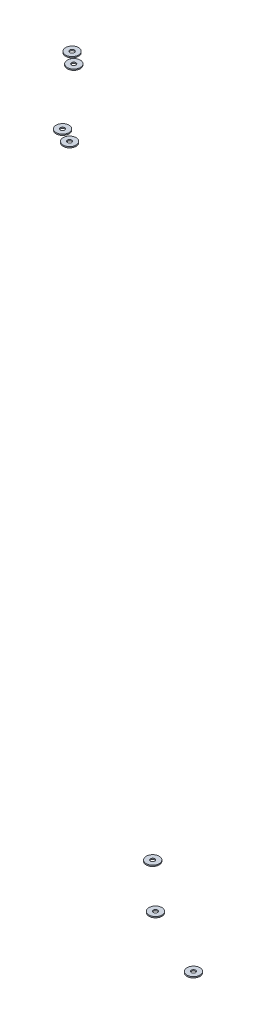
ISO-10303-21;
HEADER;
FILE_DESCRIPTION(('STEP AP214'),'2;1');
FILE_NAME('part.step','',(''),(''),'','','');
FILE_SCHEMA(('AUTOMOTIVE_DESIGN { 1 0 10303 214 1 1 1 1 }'));
ENDSEC;
DATA;
#1=APPLICATION_CONTEXT('core data for automotive mechanical design processes');
#2=APPLICATION_PROTOCOL_DEFINITION('international standard','automotive_design',2000,#1);
#3=PRODUCT_CONTEXT('',#1,'mechanical');
#4=PRODUCT('Part','Part','',(#3));
#5=PRODUCT_RELATED_PRODUCT_CATEGORY('part','',(#4));
#6=PRODUCT_DEFINITION_FORMATION('','',#4);
#7=PRODUCT_DEFINITION_CONTEXT('part definition',#1,'design');
#8=PRODUCT_DEFINITION('design','',#6,#7);
#9=PRODUCT_DEFINITION_SHAPE('','',#8);
#10=(LENGTH_UNIT() NAMED_UNIT(*) SI_UNIT(.MILLI.,.METRE.));
#11=(NAMED_UNIT(*) PLANE_ANGLE_UNIT() SI_UNIT($,.RADIAN.));
#12=(NAMED_UNIT(*) SI_UNIT($,.STERADIAN.) SOLID_ANGLE_UNIT());
#13=UNCERTAINTY_MEASURE_WITH_UNIT(LENGTH_MEASURE(1.E-05),#10,'distance_accuracy_value','');
#14=(GEOMETRIC_REPRESENTATION_CONTEXT(3) GLOBAL_UNCERTAINTY_ASSIGNED_CONTEXT((#13)) GLOBAL_UNIT_ASSIGNED_CONTEXT((#10,
#11,#12)) REPRESENTATION_CONTEXT('',''));
#15=CARTESIAN_POINT('',(0.,0.,0.));
#16=DIRECTION('',(0.,0.,1.));
#17=DIRECTION('',(1.,0.,0.));
#18=AXIS2_PLACEMENT_3D('',#15,#16,#17);
#19=CARTESIAN_POINT('',(-289.687055909534,293.9,-282.424125212571));
#20=DIRECTION('',(0.,-1.,0.));
#21=DIRECTION('',(0.,0.,1.));
#22=AXIS2_PLACEMENT_3D('',#19,#20,#21);
#23=PLANE('',#22);
#24=CARTESIAN_POINT('',(-289.687055909534,293.9,-282.424125212571));
#25=DIRECTION('',(0.,1.,0.));
#26=DIRECTION('',(0.,0.,1.));
#27=AXIS2_PLACEMENT_3D('',#24,#25,#26);
#28=CIRCLE('',#27,4.50000000000002);
#29=CARTESIAN_POINT('',(-289.687055909534,293.9,-277.924125212571));
#30=VERTEX_POINT('',#29);
#31=EDGE_CURVE('E11',#30,#30,#28,.T.);
#32=ORIENTED_EDGE('',*,*,#31,.F.);
#33=EDGE_LOOP('',(#32));
#34=FACE_BOUND('',#33,.T.);
#35=CARTESIAN_POINT('',(-289.687055909534,293.9,-282.424125212571));
#36=DIRECTION('',(0.,1.,0.));
#37=DIRECTION('',(0.,0.,1.));
#38=AXIS2_PLACEMENT_3D('',#35,#36,#37);
#39=CIRCLE('',#38,1.50000000000002);
#40=CARTESIAN_POINT('',(-289.687055909534,293.9,-280.924125212571));
#41=VERTEX_POINT('',#40);
#42=EDGE_CURVE('E55',#41,#41,#39,.T.);
#43=ORIENTED_EDGE('',*,*,#42,.T.);
#44=EDGE_LOOP('',(#43));
#45=FACE_BOUND('',#44,.T.);
#46=ADVANCED_FACE('F44',(#34,#45),#23,.T.);
#47=CARTESIAN_POINT('',(-289.687055909534,294.7,-282.424125212571));
#48=DIRECTION('',(0.,-1.,0.));
#49=DIRECTION('',(0.,0.,1.));
#50=AXIS2_PLACEMENT_3D('',#47,#48,#49);
#51=PLANE('',#50);
#52=CARTESIAN_POINT('',(-289.687055909534,294.7,-282.424125212571));
#53=DIRECTION('',(0.,1.,0.));
#54=DIRECTION('',(0.,0.,1.));
#55=AXIS2_PLACEMENT_3D('',#52,#53,#54);
#56=CIRCLE('',#55,4.50000000000002);
#57=CARTESIAN_POINT('',(-289.687055909534,294.7,-277.924125212571));
#58=VERTEX_POINT('',#57);
#59=EDGE_CURVE('E48',#58,#58,#56,.T.);
#60=ORIENTED_EDGE('',*,*,#59,.T.);
#61=EDGE_LOOP('',(#60));
#62=FACE_BOUND('',#61,.T.);
#63=CARTESIAN_POINT('',(-289.687055909534,294.7,-282.424125212571));
#64=DIRECTION('',(0.,1.,0.));
#65=DIRECTION('',(0.,0.,1.));
#66=AXIS2_PLACEMENT_3D('',#63,#64,#65);
#67=CIRCLE('',#66,1.50000000000002);
#68=CARTESIAN_POINT('',(-289.687055909534,294.7,-280.924125212571));
#69=VERTEX_POINT('',#68);
#70=EDGE_CURVE('E57',#69,#69,#67,.T.);
#71=ORIENTED_EDGE('',*,*,#70,.F.);
#72=EDGE_LOOP('',(#71));
#73=FACE_BOUND('',#72,.T.);
#74=ADVANCED_FACE('F70',(#62,#73),#51,.F.);
#75=CARTESIAN_POINT('',(-289.687055909534,293.9,-282.424125212571));
#76=DIRECTION('',(0.,1.,0.));
#77=DIRECTION('',(0.,0.,-1.));
#78=AXIS2_PLACEMENT_3D('',#75,#76,#77);
#79=CYLINDRICAL_SURFACE('',#78,4.50000000000002);
#80=ORIENTED_EDGE('',*,*,#31,.T.);
#81=EDGE_LOOP('',(#80));
#82=FACE_BOUND('',#81,.T.);
#83=ORIENTED_EDGE('',*,*,#59,.F.);
#84=EDGE_LOOP('',(#83));
#85=FACE_BOUND('',#84,.T.);
#86=ADVANCED_FACE('F46',(#82,#85),#79,.T.);
#87=CARTESIAN_POINT('',(-289.687055909534,293.9,-282.424125212571));
#88=DIRECTION('',(0.,1.,0.));
#89=DIRECTION('',(0.,0.,-1.));
#90=AXIS2_PLACEMENT_3D('',#87,#88,#89);
#91=CYLINDRICAL_SURFACE('',#90,1.50000000000002);
#92=ORIENTED_EDGE('',*,*,#42,.F.);
#93=EDGE_LOOP('',(#92));
#94=FACE_BOUND('',#93,.T.);
#95=ORIENTED_EDGE('',*,*,#70,.T.);
#96=EDGE_LOOP('',(#95));
#97=FACE_BOUND('',#96,.T.);
#98=ADVANCED_FACE('F64',(#94,#97),#91,.F.);
#99=CLOSED_SHELL('',(#46,#74,#86,#98));
#100=MANIFOLD_SOLID_BREP('B2',#99);
#101=CARTESIAN_POINT('',(-339.082998520851,293.9,-305.429754445409));
#102=DIRECTION('',(0.,-1.,0.));
#103=DIRECTION('',(0.,0.,1.));
#104=AXIS2_PLACEMENT_3D('',#101,#102,#103);
#105=PLANE('',#104);
#106=CARTESIAN_POINT('',(-339.082998520851,293.9,-305.429754445409));
#107=DIRECTION('',(0.,1.,0.));
#108=DIRECTION('',(0.,0.,1.));
#109=AXIS2_PLACEMENT_3D('',#106,#107,#108);
#110=CIRCLE('',#109,4.50000000000002);
#111=CARTESIAN_POINT('',(-339.082998520851,293.9,-300.929754445409));
#112=VERTEX_POINT('',#111);
#113=EDGE_CURVE('E43',#112,#112,#110,.T.);
#114=ORIENTED_EDGE('',*,*,#113,.F.);
#115=EDGE_LOOP('',(#114));
#116=FACE_BOUND('',#115,.T.);
#117=CARTESIAN_POINT('',(-339.082998520851,293.9,-305.429754445409));
#118=DIRECTION('',(0.,1.,0.));
#119=DIRECTION('',(0.,0.,1.));
#120=AXIS2_PLACEMENT_3D('',#117,#118,#119);
#121=CIRCLE('',#120,1.50000000000002);
#122=CARTESIAN_POINT('',(-339.082998520851,293.9,-303.929754445409));
#123=VERTEX_POINT('',#122);
#124=EDGE_CURVE('E125',#123,#123,#121,.T.);
#125=ORIENTED_EDGE('',*,*,#124,.T.);
#126=EDGE_LOOP('',(#125));
#127=FACE_BOUND('',#126,.T.);
#128=ADVANCED_FACE('F114',(#116,#127),#105,.T.);
#129=CARTESIAN_POINT('',(-339.082998520851,294.7,-305.429754445409));
#130=DIRECTION('',(0.,-1.,0.));
#131=DIRECTION('',(0.,0.,1.));
#132=AXIS2_PLACEMENT_3D('',#129,#130,#131);
#133=PLANE('',#132);
#134=CARTESIAN_POINT('',(-339.082998520851,294.7,-305.429754445409));
#135=DIRECTION('',(0.,1.,0.));
#136=DIRECTION('',(0.,0.,1.));
#137=AXIS2_PLACEMENT_3D('',#134,#135,#136);
#138=CIRCLE('',#137,4.50000000000002);
#139=CARTESIAN_POINT('',(-339.082998520851,294.7,-300.929754445409));
#140=VERTEX_POINT('',#139);
#141=EDGE_CURVE('E118',#140,#140,#138,.T.);
#142=ORIENTED_EDGE('',*,*,#141,.T.);
#143=EDGE_LOOP('',(#142));
#144=FACE_BOUND('',#143,.T.);
#145=CARTESIAN_POINT('',(-339.082998520851,294.7,-305.429754445409));
#146=DIRECTION('',(0.,1.,0.));
#147=DIRECTION('',(0.,0.,1.));
#148=AXIS2_PLACEMENT_3D('',#145,#146,#147);
#149=CIRCLE('',#148,1.50000000000002);
#150=CARTESIAN_POINT('',(-339.082998520851,294.7,-303.929754445409));
#151=VERTEX_POINT('',#150);
#152=EDGE_CURVE('E127',#151,#151,#149,.T.);
#153=ORIENTED_EDGE('',*,*,#152,.F.);
#154=EDGE_LOOP('',(#153));
#155=FACE_BOUND('',#154,.T.);
#156=ADVANCED_FACE('F140',(#144,#155),#133,.F.);
#157=CARTESIAN_POINT('',(-339.082998520851,293.9,-305.429754445409));
#158=DIRECTION('',(0.,1.,0.));
#159=DIRECTION('',(0.,0.,-1.));
#160=AXIS2_PLACEMENT_3D('',#157,#158,#159);
#161=CYLINDRICAL_SURFACE('',#160,4.50000000000002);
#162=ORIENTED_EDGE('',*,*,#113,.T.);
#163=EDGE_LOOP('',(#162));
#164=FACE_BOUND('',#163,.T.);
#165=ORIENTED_EDGE('',*,*,#141,.F.);
#166=EDGE_LOOP('',(#165));
#167=FACE_BOUND('',#166,.T.);
#168=ADVANCED_FACE('F116',(#164,#167),#161,.T.);
#169=CARTESIAN_POINT('',(-339.082998520851,293.9,-305.429754445409));
#170=DIRECTION('',(0.,1.,0.));
#171=DIRECTION('',(0.,0.,-1.));
#172=AXIS2_PLACEMENT_3D('',#169,#170,#171);
#173=CYLINDRICAL_SURFACE('',#172,1.50000000000002);
#174=ORIENTED_EDGE('',*,*,#124,.F.);
#175=EDGE_LOOP('',(#174));
#176=FACE_BOUND('',#175,.T.);
#177=ORIENTED_EDGE('',*,*,#152,.T.);
#178=EDGE_LOOP('',(#177));
#179=FACE_BOUND('',#178,.T.);
#180=ADVANCED_FACE('F134',(#176,#179),#173,.F.);
#181=CLOSED_SHELL('',(#128,#156,#168,#180));
#182=MANIFOLD_SOLID_BREP('B6',#181);
#183=CARTESIAN_POINT('',(-370.956911026411,293.9,-335.367132453118));
#184=DIRECTION('',(0.,-1.,0.));
#185=DIRECTION('',(0.,0.,1.));
#186=AXIS2_PLACEMENT_3D('',#183,#184,#185);
#187=PLANE('',#186);
#188=CARTESIAN_POINT('',(-370.956911026411,293.9,-335.367132453118));
#189=DIRECTION('',(0.,1.,0.));
#190=DIRECTION('',(0.,0.,1.));
#191=AXIS2_PLACEMENT_3D('',#188,#189,#190);
#192=CIRCLE('',#191,4.50000000000002);
#193=CARTESIAN_POINT('',(-370.956911026411,293.9,-330.867132453118));
#194=VERTEX_POINT('',#193);
#195=EDGE_CURVE('E113',#194,#194,#192,.T.);
#196=ORIENTED_EDGE('',*,*,#195,.F.);
#197=EDGE_LOOP('',(#196));
#198=FACE_BOUND('',#197,.T.);
#199=CARTESIAN_POINT('',(-370.956911026411,293.9,-335.367132453118));
#200=DIRECTION('',(0.,1.,0.));
#201=DIRECTION('',(0.,0.,1.));
#202=AXIS2_PLACEMENT_3D('',#199,#200,#201);
#203=CIRCLE('',#202,1.50000000000002);
#204=CARTESIAN_POINT('',(-370.956911026411,293.9,-333.867132453118));
#205=VERTEX_POINT('',#204);
#206=EDGE_CURVE('E195',#205,#205,#203,.T.);
#207=ORIENTED_EDGE('',*,*,#206,.T.);
#208=EDGE_LOOP('',(#207));
#209=FACE_BOUND('',#208,.T.);
#210=ADVANCED_FACE('F184',(#198,#209),#187,.T.);
#211=CARTESIAN_POINT('',(-370.956911026411,294.7,-335.367132453118));
#212=DIRECTION('',(0.,-1.,0.));
#213=DIRECTION('',(0.,0.,1.));
#214=AXIS2_PLACEMENT_3D('',#211,#212,#213);
#215=PLANE('',#214);
#216=CARTESIAN_POINT('',(-370.956911026411,294.7,-335.367132453118));
#217=DIRECTION('',(0.,1.,0.));
#218=DIRECTION('',(0.,0.,1.));
#219=AXIS2_PLACEMENT_3D('',#216,#217,#218);
#220=CIRCLE('',#219,4.50000000000002);
#221=CARTESIAN_POINT('',(-370.956911026411,294.7,-330.867132453118));
#222=VERTEX_POINT('',#221);
#223=EDGE_CURVE('E188',#222,#222,#220,.T.);
#224=ORIENTED_EDGE('',*,*,#223,.T.);
#225=EDGE_LOOP('',(#224));
#226=FACE_BOUND('',#225,.T.);
#227=CARTESIAN_POINT('',(-370.956911026411,294.7,-335.367132453118));
#228=DIRECTION('',(0.,1.,0.));
#229=DIRECTION('',(0.,0.,1.));
#230=AXIS2_PLACEMENT_3D('',#227,#228,#229);
#231=CIRCLE('',#230,1.50000000000002);
#232=CARTESIAN_POINT('',(-370.956911026411,294.7,-333.867132453118));
#233=VERTEX_POINT('',#232);
#234=EDGE_CURVE('E197',#233,#233,#231,.T.);
#235=ORIENTED_EDGE('',*,*,#234,.F.);
#236=EDGE_LOOP('',(#235));
#237=FACE_BOUND('',#236,.T.);
#238=ADVANCED_FACE('F210',(#226,#237),#215,.F.);
#239=CARTESIAN_POINT('',(-370.956911026411,293.9,-335.367132453118));
#240=DIRECTION('',(0.,1.,0.));
#241=DIRECTION('',(0.,0.,-1.));
#242=AXIS2_PLACEMENT_3D('',#239,#240,#241);
#243=CYLINDRICAL_SURFACE('',#242,4.50000000000002);
#244=ORIENTED_EDGE('',*,*,#195,.T.);
#245=EDGE_LOOP('',(#244));
#246=FACE_BOUND('',#245,.T.);
#247=ORIENTED_EDGE('',*,*,#223,.F.);
#248=EDGE_LOOP('',(#247));
#249=FACE_BOUND('',#248,.T.);
#250=ADVANCED_FACE('F186',(#246,#249),#243,.T.);
#251=CARTESIAN_POINT('',(-370.956911026411,293.9,-335.367132453118));
#252=DIRECTION('',(0.,1.,0.));
#253=DIRECTION('',(0.,0.,-1.));
#254=AXIS2_PLACEMENT_3D('',#251,#252,#253);
#255=CYLINDRICAL_SURFACE('',#254,1.50000000000002);
#256=ORIENTED_EDGE('',*,*,#206,.F.);
#257=EDGE_LOOP('',(#256));
#258=FACE_BOUND('',#257,.T.);
#259=ORIENTED_EDGE('',*,*,#234,.T.);
#260=EDGE_LOOP('',(#259));
#261=FACE_BOUND('',#260,.T.);
#262=ADVANCED_FACE('F204',(#258,#261),#255,.F.);
#263=CLOSED_SHELL('',(#210,#238,#250,#262));
#264=MANIFOLD_SOLID_BREP('B38',#263);
#265=CARTESIAN_POINT('',(-474.449169572246,706.1,-382.793687092254));
#266=DIRECTION('',(0.,1.,0.));
#267=DIRECTION('',(0.,0.,-1.));
#268=AXIS2_PLACEMENT_3D('',#265,#266,#267);
#269=PLANE('',#268);
#270=CARTESIAN_POINT('',(-474.449169572246,706.1,-382.793687092254));
#271=DIRECTION('',(0.,-1.,0.));
#272=DIRECTION('',(0.,0.,-1.));
#273=AXIS2_PLACEMENT_3D('',#270,#271,#272);
#274=CIRCLE('',#273,4.50000000000002);
#275=CARTESIAN_POINT('',(-474.449169572246,706.1,-387.293687092254));
#276=VERTEX_POINT('',#275);
#277=EDGE_CURVE('E183',#276,#276,#274,.T.);
#278=ORIENTED_EDGE('',*,*,#277,.F.);
#279=EDGE_LOOP('',(#278));
#280=FACE_BOUND('',#279,.T.);
#281=CARTESIAN_POINT('',(-474.449169572246,706.1,-382.793687092254));
#282=DIRECTION('',(0.,-1.,0.));
#283=DIRECTION('',(0.,0.,-1.));
#284=AXIS2_PLACEMENT_3D('',#281,#282,#283);
#285=CIRCLE('',#284,1.6059145248098);
#286=CARTESIAN_POINT('',(-474.449169572246,706.1,-384.399601617063));
#287=VERTEX_POINT('',#286);
#288=EDGE_CURVE('E265',#287,#287,#285,.T.);
#289=ORIENTED_EDGE('',*,*,#288,.T.);
#290=EDGE_LOOP('',(#289));
#291=FACE_BOUND('',#290,.T.);
#292=ADVANCED_FACE('F254',(#280,#291),#269,.T.);
#293=CARTESIAN_POINT('',(-474.449169572246,705.3,-382.793687092254));
#294=DIRECTION('',(0.,1.,0.));
#295=DIRECTION('',(0.,0.,-1.));
#296=AXIS2_PLACEMENT_3D('',#293,#294,#295);
#297=PLANE('',#296);
#298=CARTESIAN_POINT('',(-474.449169572246,705.3,-382.793687092254));
#299=DIRECTION('',(0.,-1.,0.));
#300=DIRECTION('',(0.,0.,-1.));
#301=AXIS2_PLACEMENT_3D('',#298,#299,#300);
#302=CIRCLE('',#301,4.50000000000002);
#303=CARTESIAN_POINT('',(-474.449169572246,705.3,-387.293687092254));
#304=VERTEX_POINT('',#303);
#305=EDGE_CURVE('E258',#304,#304,#302,.T.);
#306=ORIENTED_EDGE('',*,*,#305,.T.);
#307=EDGE_LOOP('',(#306));
#308=FACE_BOUND('',#307,.T.);
#309=CARTESIAN_POINT('',(-474.449169572246,705.3,-382.793687092254));
#310=DIRECTION('',(0.,-1.,0.));
#311=DIRECTION('',(0.,0.,-1.));
#312=AXIS2_PLACEMENT_3D('',#309,#310,#311);
#313=CIRCLE('',#312,1.6059145248098);
#314=CARTESIAN_POINT('',(-474.449169572246,705.3,-384.399601617063));
#315=VERTEX_POINT('',#314);
#316=EDGE_CURVE('E267',#315,#315,#313,.T.);
#317=ORIENTED_EDGE('',*,*,#316,.F.);
#318=EDGE_LOOP('',(#317));
#319=FACE_BOUND('',#318,.T.);
#320=ADVANCED_FACE('F280',(#308,#319),#297,.F.);
#321=CARTESIAN_POINT('',(-474.449169572246,706.1,-382.793687092254));
#322=DIRECTION('',(0.,-1.,0.));
#323=DIRECTION('',(0.,0.,1.));
#324=AXIS2_PLACEMENT_3D('',#321,#322,#323);
#325=CYLINDRICAL_SURFACE('',#324,4.50000000000002);
#326=ORIENTED_EDGE('',*,*,#277,.T.);
#327=EDGE_LOOP('',(#326));
#328=FACE_BOUND('',#327,.T.);
#329=ORIENTED_EDGE('',*,*,#305,.F.);
#330=EDGE_LOOP('',(#329));
#331=FACE_BOUND('',#330,.T.);
#332=ADVANCED_FACE('F256',(#328,#331),#325,.T.);
#333=CARTESIAN_POINT('',(-474.449169572246,706.1,-382.793687092254));
#334=DIRECTION('',(0.,-1.,0.));
#335=DIRECTION('',(0.,0.,1.));
#336=AXIS2_PLACEMENT_3D('',#333,#334,#335);
#337=CYLINDRICAL_SURFACE('',#336,1.6059145248098);
#338=ORIENTED_EDGE('',*,*,#288,.F.);
#339=EDGE_LOOP('',(#338));
#340=FACE_BOUND('',#339,.T.);
#341=ORIENTED_EDGE('',*,*,#316,.T.);
#342=EDGE_LOOP('',(#341));
#343=FACE_BOUND('',#342,.T.);
#344=ADVANCED_FACE('F274',(#340,#343),#337,.F.);
#345=CLOSED_SHELL('',(#292,#320,#332,#344));
#346=MANIFOLD_SOLID_BREP('B108',#345);
#347=CARTESIAN_POINT('',(-466.308050673724,706.1,-375.859415010098));
#348=DIRECTION('',(0.,1.,0.));
#349=DIRECTION('',(0.,0.,-1.));
#350=AXIS2_PLACEMENT_3D('',#347,#348,#349);
#351=PLANE('',#350);
#352=CARTESIAN_POINT('',(-466.308050673724,706.1,-375.859415010098));
#353=DIRECTION('',(0.,-1.,0.));
#354=DIRECTION('',(0.,0.,-1.));
#355=AXIS2_PLACEMENT_3D('',#352,#353,#354);
#356=CIRCLE('',#355,4.50000000000002);
#357=CARTESIAN_POINT('',(-466.308050673724,706.1,-380.359415010098));
#358=VERTEX_POINT('',#357);
#359=EDGE_CURVE('E253',#358,#358,#356,.T.);
#360=ORIENTED_EDGE('',*,*,#359,.F.);
#361=EDGE_LOOP('',(#360));
#362=FACE_BOUND('',#361,.T.);
#363=CARTESIAN_POINT('',(-466.308050673724,706.1,-375.859415010098));
#364=DIRECTION('',(0.,-1.,0.));
#365=DIRECTION('',(0.,0.,-1.));
#366=AXIS2_PLACEMENT_3D('',#363,#364,#365);
#367=CIRCLE('',#366,1.50000000000002);
#368=CARTESIAN_POINT('',(-466.308050673724,706.1,-377.359415010098));
#369=VERTEX_POINT('',#368);
#370=EDGE_CURVE('E335',#369,#369,#367,.T.);
#371=ORIENTED_EDGE('',*,*,#370,.T.);
#372=EDGE_LOOP('',(#371));
#373=FACE_BOUND('',#372,.T.);
#374=ADVANCED_FACE('F324',(#362,#373),#351,.T.);
#375=CARTESIAN_POINT('',(-466.308050673724,705.3,-375.859415010098));
#376=DIRECTION('',(0.,1.,0.));
#377=DIRECTION('',(0.,0.,-1.));
#378=AXIS2_PLACEMENT_3D('',#375,#376,#377);
#379=PLANE('',#378);
#380=CARTESIAN_POINT('',(-466.308050673724,705.3,-375.859415010098));
#381=DIRECTION('',(0.,-1.,0.));
#382=DIRECTION('',(0.,0.,-1.));
#383=AXIS2_PLACEMENT_3D('',#380,#381,#382);
#384=CIRCLE('',#383,4.50000000000002);
#385=CARTESIAN_POINT('',(-466.308050673724,705.3,-380.359415010098));
#386=VERTEX_POINT('',#385);
#387=EDGE_CURVE('E328',#386,#386,#384,.T.);
#388=ORIENTED_EDGE('',*,*,#387,.T.);
#389=EDGE_LOOP('',(#388));
#390=FACE_BOUND('',#389,.T.);
#391=CARTESIAN_POINT('',(-466.308050673724,705.3,-375.859415010098));
#392=DIRECTION('',(0.,-1.,0.));
#393=DIRECTION('',(0.,0.,-1.));
#394=AXIS2_PLACEMENT_3D('',#391,#392,#393);
#395=CIRCLE('',#394,1.50000000000002);
#396=CARTESIAN_POINT('',(-466.308050673724,705.3,-377.359415010098));
#397=VERTEX_POINT('',#396);
#398=EDGE_CURVE('E337',#397,#397,#395,.T.);
#399=ORIENTED_EDGE('',*,*,#398,.F.);
#400=EDGE_LOOP('',(#399));
#401=FACE_BOUND('',#400,.T.);
#402=ADVANCED_FACE('F350',(#390,#401),#379,.F.);
#403=CARTESIAN_POINT('',(-466.308050673724,706.1,-375.859415010098));
#404=DIRECTION('',(0.,-1.,0.));
#405=DIRECTION('',(0.,0.,1.));
#406=AXIS2_PLACEMENT_3D('',#403,#404,#405);
#407=CYLINDRICAL_SURFACE('',#406,4.50000000000002);
#408=ORIENTED_EDGE('',*,*,#359,.T.);
#409=EDGE_LOOP('',(#408));
#410=FACE_BOUND('',#409,.T.);
#411=ORIENTED_EDGE('',*,*,#387,.F.);
#412=EDGE_LOOP('',(#411));
#413=FACE_BOUND('',#412,.T.);
#414=ADVANCED_FACE('F326',(#410,#413),#407,.T.);
#415=CARTESIAN_POINT('',(-466.308050673724,706.1,-375.859415010098));
#416=DIRECTION('',(0.,-1.,0.));
#417=DIRECTION('',(0.,0.,1.));
#418=AXIS2_PLACEMENT_3D('',#415,#416,#417);
#419=CYLINDRICAL_SURFACE('',#418,1.50000000000002);
#420=ORIENTED_EDGE('',*,*,#370,.F.);
#421=EDGE_LOOP('',(#420));
#422=FACE_BOUND('',#421,.T.);
#423=ORIENTED_EDGE('',*,*,#398,.T.);
#424=EDGE_LOOP('',(#423));
#425=FACE_BOUND('',#424,.T.);
#426=ADVANCED_FACE('F344',(#422,#425),#419,.F.);
#427=CLOSED_SHELL('',(#374,#402,#414,#426));
#428=MANIFOLD_SOLID_BREP('B178',#427);
#429=CARTESIAN_POINT('',(-431.039698401952,706.1,-332.774189517311));
#430=DIRECTION('',(0.,1.,0.));
#431=DIRECTION('',(0.,0.,-1.));
#432=AXIS2_PLACEMENT_3D('',#429,#430,#431);
#433=PLANE('',#432);
#434=CARTESIAN_POINT('',(-431.039698401952,706.1,-332.774189517311));
#435=DIRECTION('',(0.,-1.,0.));
#436=DIRECTION('',(0.,0.,-1.));
#437=AXIS2_PLACEMENT_3D('',#434,#435,#436);
#438=CIRCLE('',#437,4.50000000000002);
#439=CARTESIAN_POINT('',(-431.039698401952,706.1,-337.274189517311));
#440=VERTEX_POINT('',#439);
#441=EDGE_CURVE('E323',#440,#440,#438,.T.);
#442=ORIENTED_EDGE('',*,*,#441,.F.);
#443=EDGE_LOOP('',(#442));
#444=FACE_BOUND('',#443,.T.);
#445=CARTESIAN_POINT('',(-431.039698401952,706.1,-332.774189517311));
#446=DIRECTION('',(0.,-1.,0.));
#447=DIRECTION('',(0.,0.,-1.));
#448=AXIS2_PLACEMENT_3D('',#445,#446,#447);
#449=CIRCLE('',#448,1.49999999999997);
#450=CARTESIAN_POINT('',(-431.039698401952,706.1,-334.274189517311));
#451=VERTEX_POINT('',#450);
#452=EDGE_CURVE('E404',#451,#451,#449,.T.);
#453=ORIENTED_EDGE('',*,*,#452,.T.);
#454=EDGE_LOOP('',(#453));
#455=FACE_BOUND('',#454,.T.);
#456=ADVANCED_FACE('F393',(#444,#455),#433,.T.);
#457=CARTESIAN_POINT('',(-431.039698401952,705.3,-332.774189517311));
#458=DIRECTION('',(0.,1.,0.));
#459=DIRECTION('',(0.,0.,-1.));
#460=AXIS2_PLACEMENT_3D('',#457,#458,#459);
#461=PLANE('',#460);
#462=CARTESIAN_POINT('',(-431.039698401952,705.3,-332.774189517311));
#463=DIRECTION('',(0.,-1.,0.));
#464=DIRECTION('',(0.,0.,-1.));
#465=AXIS2_PLACEMENT_3D('',#462,#463,#464);
#466=CIRCLE('',#465,4.50000000000002);
#467=CARTESIAN_POINT('',(-431.039698401952,705.3,-337.274189517311));
#468=VERTEX_POINT('',#467);
#469=EDGE_CURVE('E397',#468,#468,#466,.T.);
#470=ORIENTED_EDGE('',*,*,#469,.T.);
#471=EDGE_LOOP('',(#470));
#472=FACE_BOUND('',#471,.T.);
#473=CARTESIAN_POINT('',(-431.039698401952,705.3,-332.774189517311));
#474=DIRECTION('',(0.,-1.,0.));
#475=DIRECTION('',(0.,0.,-1.));
#476=AXIS2_PLACEMENT_3D('',#473,#474,#475);
#477=CIRCLE('',#476,1.49999999999997);
#478=CARTESIAN_POINT('',(-431.039698401952,705.3,-334.274189517311));
#479=VERTEX_POINT('',#478);
#480=EDGE_CURVE('E406',#479,#479,#477,.T.);
#481=ORIENTED_EDGE('',*,*,#480,.F.);
#482=EDGE_LOOP('',(#481));
#483=FACE_BOUND('',#482,.T.);
#484=ADVANCED_FACE('F419',(#472,#483),#461,.F.);
#485=CARTESIAN_POINT('',(-431.039698401952,706.1,-332.774189517311));
#486=DIRECTION('',(0.,-1.,0.));
#487=DIRECTION('',(0.,0.,1.));
#488=AXIS2_PLACEMENT_3D('',#485,#486,#487);
#489=CYLINDRICAL_SURFACE('',#488,4.50000000000002);
#490=ORIENTED_EDGE('',*,*,#441,.T.);
#491=EDGE_LOOP('',(#490));
#492=FACE_BOUND('',#491,.T.);
#493=ORIENTED_EDGE('',*,*,#469,.F.);
#494=EDGE_LOOP('',(#493));
#495=FACE_BOUND('',#494,.T.);
#496=ADVANCED_FACE('F395',(#492,#495),#489,.T.);
#497=CARTESIAN_POINT('',(-431.039698401952,706.1,-332.774189517311));
#498=DIRECTION('',(0.,-1.,0.));
#499=DIRECTION('',(0.,0.,1.));
#500=AXIS2_PLACEMENT_3D('',#497,#498,#499);
#501=CYLINDRICAL_SURFACE('',#500,1.49999999999997);
#502=ORIENTED_EDGE('',*,*,#452,.F.);
#503=EDGE_LOOP('',(#502));
#504=FACE_BOUND('',#503,.T.);
#505=ORIENTED_EDGE('',*,*,#480,.T.);
#506=EDGE_LOOP('',(#505));
#507=FACE_BOUND('',#506,.T.);
#508=ADVANCED_FACE('F413',(#504,#507),#501,.F.);
#509=CLOSED_SHELL('',(#456,#484,#496,#508));
#510=MANIFOLD_SOLID_BREP('B248',#509);
#511=CARTESIAN_POINT('',(-421.090050281492,706.1,-327.725114351705));
#512=DIRECTION('',(0.,1.,0.));
#513=DIRECTION('',(0.,0.,-1.));
#514=AXIS2_PLACEMENT_3D('',#511,#512,#513);
#515=PLANE('',#514);
#516=CARTESIAN_POINT('',(-421.090050281492,706.1,-327.725114351705));
#517=DIRECTION('',(0.,-1.,0.));
#518=DIRECTION('',(0.,0.,-1.));
#519=AXIS2_PLACEMENT_3D('',#516,#517,#518);
#520=CIRCLE('',#519,4.50000000000002);
#521=CARTESIAN_POINT('',(-421.090050281492,706.1,-332.225114351705));
#522=VERTEX_POINT('',#521);
#523=EDGE_CURVE('E392',#522,#522,#520,.T.);
#524=ORIENTED_EDGE('',*,*,#523,.F.);
#525=EDGE_LOOP('',(#524));
#526=FACE_BOUND('',#525,.T.);
#527=CARTESIAN_POINT('',(-421.090050281492,706.1,-327.725114351705));
#528=DIRECTION('',(0.,-1.,0.));
#529=DIRECTION('',(0.,0.,-1.));
#530=AXIS2_PLACEMENT_3D('',#527,#528,#529);
#531=CIRCLE('',#530,1.49999999999997);
#532=CARTESIAN_POINT('',(-421.090050281492,706.1,-329.225114351705));
#533=VERTEX_POINT('',#532);
#534=EDGE_CURVE('E466',#533,#533,#531,.T.);
#535=ORIENTED_EDGE('',*,*,#534,.T.);
#536=EDGE_LOOP('',(#535));
#537=FACE_BOUND('',#536,.T.);
#538=ADVANCED_FACE('F455',(#526,#537),#515,.T.);
#539=CARTESIAN_POINT('',(-421.090050281492,705.3,-327.725114351705));
#540=DIRECTION('',(0.,1.,0.));
#541=DIRECTION('',(0.,0.,-1.));
#542=AXIS2_PLACEMENT_3D('',#539,#540,#541);
#543=PLANE('',#542);
#544=CARTESIAN_POINT('',(-421.090050281492,705.3,-327.725114351705));
#545=DIRECTION('',(0.,-1.,0.));
#546=DIRECTION('',(0.,0.,-1.));
#547=AXIS2_PLACEMENT_3D('',#544,#545,#546);
#548=CIRCLE('',#547,4.50000000000002);
#549=CARTESIAN_POINT('',(-421.090050281492,705.3,-332.225114351705));
#550=VERTEX_POINT('',#549);
#551=EDGE_CURVE('E459',#550,#550,#548,.T.);
#552=ORIENTED_EDGE('',*,*,#551,.T.);
#553=EDGE_LOOP('',(#552));
#554=FACE_BOUND('',#553,.T.);
#555=CARTESIAN_POINT('',(-421.090050281492,705.3,-327.725114351705));
#556=DIRECTION('',(0.,-1.,0.));
#557=DIRECTION('',(0.,0.,-1.));
#558=AXIS2_PLACEMENT_3D('',#555,#556,#557);
#559=CIRCLE('',#558,1.49999999999997);
#560=CARTESIAN_POINT('',(-421.090050281492,705.3,-329.225114351705));
#561=VERTEX_POINT('',#560);
#562=EDGE_CURVE('E468',#561,#561,#559,.T.);
#563=ORIENTED_EDGE('',*,*,#562,.F.);
#564=EDGE_LOOP('',(#563));
#565=FACE_BOUND('',#564,.T.);
#566=ADVANCED_FACE('F481',(#554,#565),#543,.F.);
#567=CARTESIAN_POINT('',(-421.090050281492,706.1,-327.725114351705));
#568=DIRECTION('',(0.,-1.,0.));
#569=DIRECTION('',(0.,0.,1.));
#570=AXIS2_PLACEMENT_3D('',#567,#568,#569);
#571=CYLINDRICAL_SURFACE('',#570,4.50000000000002);
#572=ORIENTED_EDGE('',*,*,#523,.T.);
#573=EDGE_LOOP('',(#572));
#574=FACE_BOUND('',#573,.T.);
#575=ORIENTED_EDGE('',*,*,#551,.F.);
#576=EDGE_LOOP('',(#575));
#577=FACE_BOUND('',#576,.T.);
#578=ADVANCED_FACE('F457',(#574,#577),#571,.T.);
#579=CARTESIAN_POINT('',(-421.090050281492,706.1,-327.725114351705));
#580=DIRECTION('',(0.,-1.,0.));
#581=DIRECTION('',(0.,0.,1.));
#582=AXIS2_PLACEMENT_3D('',#579,#580,#581);
#583=CYLINDRICAL_SURFACE('',#582,1.49999999999997);
#584=ORIENTED_EDGE('',*,*,#534,.F.);
#585=EDGE_LOOP('',(#584));
#586=FACE_BOUND('',#585,.T.);
#587=ORIENTED_EDGE('',*,*,#562,.T.);
#588=EDGE_LOOP('',(#587));
#589=FACE_BOUND('',#588,.T.);
#590=ADVANCED_FACE('F475',(#586,#589),#583,.F.);
#591=CLOSED_SHELL('',(#538,#566,#578,#590));
#592=MANIFOLD_SOLID_BREP('B318',#591);
#593=ADVANCED_BREP_SHAPE_REPRESENTATION('',(#18,#100,#182,#264,#346,#428,#510,#592),#14);
#594=SHAPE_DEFINITION_REPRESENTATION(#9,#593);
ENDSEC;
END-ISO-10303-21;
